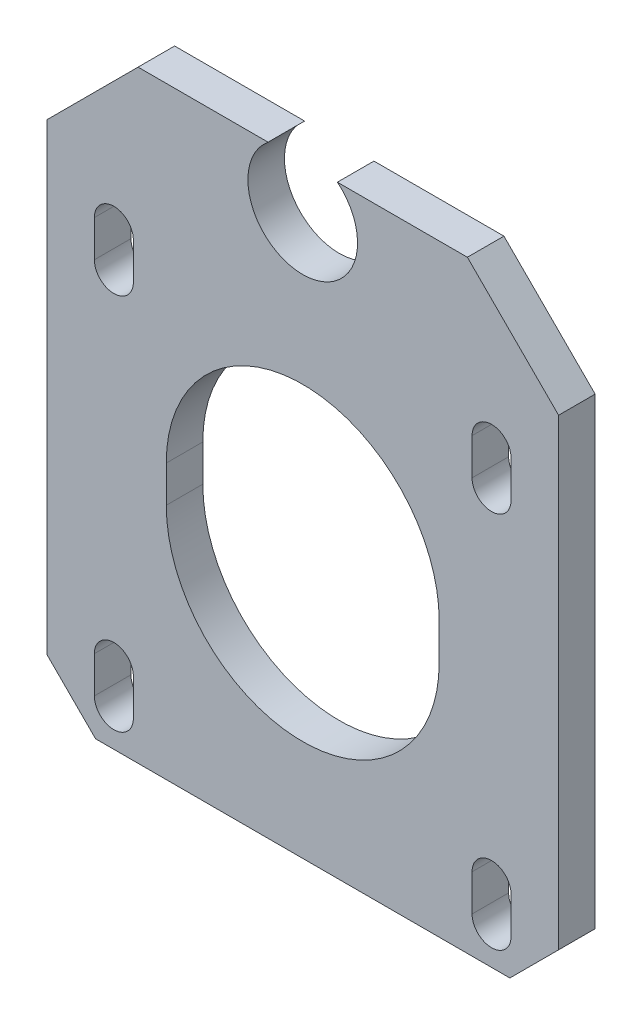
ISO-10303-21;
HEADER;
FILE_DESCRIPTION(('STEP AP214'),'2;1');
FILE_NAME('part.step','',(''),(''),'','','');
FILE_SCHEMA(('AUTOMOTIVE_DESIGN { 1 0 10303 214 1 1 1 1 }'));
ENDSEC;
DATA;
#1=APPLICATION_CONTEXT('core data for automotive mechanical design processes');
#2=APPLICATION_PROTOCOL_DEFINITION('international standard','automotive_design',2000,#1);
#3=PRODUCT_CONTEXT('',#1,'mechanical');
#4=PRODUCT('Part','Part','',(#3));
#5=PRODUCT_RELATED_PRODUCT_CATEGORY('part','',(#4));
#6=PRODUCT_DEFINITION_FORMATION('','',#4);
#7=PRODUCT_DEFINITION_CONTEXT('part definition',#1,'design');
#8=PRODUCT_DEFINITION('design','',#6,#7);
#9=PRODUCT_DEFINITION_SHAPE('','',#8);
#10=(LENGTH_UNIT() NAMED_UNIT(*) SI_UNIT(.MILLI.,.METRE.));
#11=(NAMED_UNIT(*) PLANE_ANGLE_UNIT() SI_UNIT($,.RADIAN.));
#12=(NAMED_UNIT(*) SI_UNIT($,.STERADIAN.) SOLID_ANGLE_UNIT());
#13=UNCERTAINTY_MEASURE_WITH_UNIT(LENGTH_MEASURE(1.E-05),#10,'distance_accuracy_value','');
#14=(GEOMETRIC_REPRESENTATION_CONTEXT(3) GLOBAL_UNCERTAINTY_ASSIGNED_CONTEXT((#13)) GLOBAL_UNIT_ASSIGNED_CONTEXT((#10,
#11,#12)) REPRESENTATION_CONTEXT('',''));
#15=CARTESIAN_POINT('',(0.,0.,0.));
#16=DIRECTION('',(0.,0.,1.));
#17=DIRECTION('',(1.,0.,0.));
#18=AXIS2_PLACEMENT_3D('',#15,#16,#17);
#19=CARTESIAN_POINT('',(0.,25.,3.));
#20=DIRECTION('',(0.,0.,1.));
#21=DIRECTION('',(1.,0.,0.));
#22=AXIS2_PLACEMENT_3D('',#19,#20,#21);
#23=PLANE('',#22);
#24=DIRECTION('',(1.,0.,0.));
#25=VECTOR('',#24,1.);
#26=CARTESIAN_POINT('',(-21.,-21.,3.));
#27=LINE('',#26,#25);
#28=CARTESIAN_POINT('',(-17.,-21.,3.));
#29=VERTEX_POINT('',#28);
#30=CARTESIAN_POINT('',(17.,-21.,3.));
#31=VERTEX_POINT('',#30);
#32=EDGE_CURVE('E485',#29,#31,#27,.T.);
#33=ORIENTED_EDGE('',*,*,#32,.T.);
#34=DIRECTION('',(-0.707106781186549,-0.707106781186546,0.));
#35=VECTOR('',#34,1.);
#36=CARTESIAN_POINT('',(31.5,-6.50000000000007,3.));
#37=LINE('',#36,#35);
#38=CARTESIAN_POINT('',(21.,-17.,3.));
#39=VERTEX_POINT('',#38);
#40=EDGE_CURVE('E45',#31,#39,#37,.F.);
#41=ORIENTED_EDGE('',*,*,#40,.T.);
#42=DIRECTION('',(0.,1.,0.));
#43=VECTOR('',#42,1.);
#44=CARTESIAN_POINT('',(21.,-21.,3.));
#45=LINE('',#44,#43);
#46=CARTESIAN_POINT('',(21.,21.,3.));
#47=VERTEX_POINT('',#46);
#48=EDGE_CURVE('E463',#39,#47,#45,.T.);
#49=ORIENTED_EDGE('',*,*,#48,.T.);
#50=DIRECTION('',(-0.707106781186547,0.707106781186548,0.));
#51=VECTOR('',#50,1.);
#52=CARTESIAN_POINT('',(21.,21.,3.));
#53=LINE('',#52,#51);
#54=CARTESIAN_POINT('',(13.5135929986998,28.4864070013002,3.));
#55=VERTEX_POINT('',#54);
#56=EDGE_CURVE('E466',#47,#55,#53,.T.);
#57=ORIENTED_EDGE('',*,*,#56,.T.);
#58=DIRECTION('',(-1.,0.,0.));
#59=VECTOR('',#58,1.);
#60=CARTESIAN_POINT('',(2.84516541193743,28.4864070013002,3.));
#61=LINE('',#60,#59);
#62=CARTESIAN_POINT('',(2.84516541193743,28.4864070013002,3.));
#63=VERTEX_POINT('',#62);
#64=EDGE_CURVE('E470',#55,#63,#61,.T.);
#65=ORIENTED_EDGE('',*,*,#64,.T.);
#66=CARTESIAN_POINT('',(0.,25.,3.));
#67=DIRECTION('',(0.,0.,-1.));
#68=DIRECTION('',(1.,0.,0.));
#69=AXIS2_PLACEMENT_3D('',#66,#67,#68);
#70=CIRCLE('',#69,4.5);
#71=CARTESIAN_POINT('',(-2.84516541193743,28.4864070013002,3.));
#72=VERTEX_POINT('',#71);
#73=EDGE_CURVE('E473',#63,#72,#70,.T.);
#74=ORIENTED_EDGE('',*,*,#73,.T.);
#75=DIRECTION('',(-1.,0.,0.));
#76=VECTOR('',#75,1.);
#77=CARTESIAN_POINT('',(-2.84516541193743,28.4864070013002,3.));
#78=LINE('',#77,#76);
#79=CARTESIAN_POINT('',(-13.5135929986998,28.4864070013002,3.));
#80=VERTEX_POINT('',#79);
#81=EDGE_CURVE('E476',#72,#80,#78,.T.);
#82=ORIENTED_EDGE('',*,*,#81,.T.);
#83=DIRECTION('',(-0.707106781186547,-0.707106781186548,0.));
#84=VECTOR('',#83,1.);
#85=CARTESIAN_POINT('',(-21.,21.,3.));
#86=LINE('',#85,#84);
#87=CARTESIAN_POINT('',(-21.,21.,3.));
#88=VERTEX_POINT('',#87);
#89=EDGE_CURVE('E479',#80,#88,#86,.T.);
#90=ORIENTED_EDGE('',*,*,#89,.T.);
#91=DIRECTION('',(0.,-1.,0.));
#92=VECTOR('',#91,1.);
#93=CARTESIAN_POINT('',(-21.,-21.,3.));
#94=LINE('',#93,#92);
#95=CARTESIAN_POINT('',(-21.,-17.,3.));
#96=VERTEX_POINT('',#95);
#97=EDGE_CURVE('E482',#88,#96,#94,.T.);
#98=ORIENTED_EDGE('',*,*,#97,.T.);
#99=DIRECTION('',(-0.707106781186546,0.707106781186549,0.));
#100=VECTOR('',#99,1.);
#101=CARTESIAN_POINT('',(-31.5000000000001,-6.49999999999989,3.));
#102=LINE('',#101,#100);
#103=EDGE_CURVE('E549',#96,#29,#102,.F.);
#104=ORIENTED_EDGE('',*,*,#103,.T.);
#105=EDGE_LOOP('',(#33,#41,#49,#57,#65,#74,#82,#90,#98,#104));
#106=FACE_BOUND('',#105,.T.);
#107=DIRECTION('',(0.,-1.,0.));
#108=VECTOR('',#107,1.);
#109=CARTESIAN_POINT('',(-11.2,1.49999999999999,3.));
#110=LINE('',#109,#108);
#111=CARTESIAN_POINT('',(-11.2,1.49999999999999,3.));
#112=VERTEX_POINT('',#111);
#113=CARTESIAN_POINT('',(-11.2,-1.50000000000001,3.));
#114=VERTEX_POINT('',#113);
#115=EDGE_CURVE('E423',#112,#114,#110,.T.);
#116=ORIENTED_EDGE('',*,*,#115,.F.);
#117=CARTESIAN_POINT('',(0.,1.49999999999999,3.));
#118=DIRECTION('',(0.,0.,1.));
#119=DIRECTION('',(1.,0.,0.));
#120=AXIS2_PLACEMENT_3D('',#117,#118,#119);
#121=CIRCLE('',#120,11.2);
#122=CARTESIAN_POINT('',(11.2,1.49999999999998,3.));
#123=VERTEX_POINT('',#122);
#124=EDGE_CURVE('E420',#123,#112,#121,.T.);
#125=ORIENTED_EDGE('',*,*,#124,.F.);
#126=DIRECTION('',(0.,1.,0.));
#127=VECTOR('',#126,1.);
#128=CARTESIAN_POINT('',(11.2,1.49999999999998,3.));
#129=LINE('',#128,#127);
#130=CARTESIAN_POINT('',(11.2,-1.50000000000001,3.));
#131=VERTEX_POINT('',#130);
#132=EDGE_CURVE('E431',#131,#123,#129,.T.);
#133=ORIENTED_EDGE('',*,*,#132,.F.);
#134=CARTESIAN_POINT('',(0.,-1.50000000000001,3.));
#135=DIRECTION('',(0.,0.,1.));
#136=DIRECTION('',(1.,0.,0.));
#137=AXIS2_PLACEMENT_3D('',#134,#135,#136);
#138=CIRCLE('',#137,11.2);
#139=EDGE_CURVE('E427',#114,#131,#138,.T.);
#140=ORIENTED_EDGE('',*,*,#139,.F.);
#141=EDGE_LOOP('',(#116,#125,#133,#140));
#142=FACE_BOUND('',#141,.T.);
#143=DIRECTION('',(0.,-1.,0.));
#144=VECTOR('',#143,1.);
#145=CARTESIAN_POINT('',(13.9,-15.,3.));
#146=LINE('',#145,#144);
#147=CARTESIAN_POINT('',(13.9,-15.,3.));
#148=VERTEX_POINT('',#147);
#149=CARTESIAN_POINT('',(13.9,-18.,3.));
#150=VERTEX_POINT('',#149);
#151=EDGE_CURVE('E381',#148,#150,#146,.T.);
#152=ORIENTED_EDGE('',*,*,#151,.F.);
#153=CARTESIAN_POINT('',(15.5,-15.,3.));
#154=DIRECTION('',(0.,0.,1.));
#155=DIRECTION('',(-1.,0.,0.));
#156=AXIS2_PLACEMENT_3D('',#153,#154,#155);
#157=CIRCLE('',#156,1.59999999999999);
#158=CARTESIAN_POINT('',(17.1,-15.,3.));
#159=VERTEX_POINT('',#158);
#160=EDGE_CURVE('E378',#159,#148,#157,.T.);
#161=ORIENTED_EDGE('',*,*,#160,.F.);
#162=DIRECTION('',(0.,1.,0.));
#163=VECTOR('',#162,1.);
#164=CARTESIAN_POINT('',(17.1,-15.,3.));
#165=LINE('',#164,#163);
#166=CARTESIAN_POINT('',(17.1,-18.,3.));
#167=VERTEX_POINT('',#166);
#168=EDGE_CURVE('E388',#167,#159,#165,.T.);
#169=ORIENTED_EDGE('',*,*,#168,.F.);
#170=CARTESIAN_POINT('',(15.5,-18.,3.));
#171=DIRECTION('',(0.,0.,1.));
#172=DIRECTION('',(-1.,0.,0.));
#173=AXIS2_PLACEMENT_3D('',#170,#171,#172);
#174=CIRCLE('',#173,1.59999999999999);
#175=EDGE_CURVE('E384',#150,#167,#174,.T.);
#176=ORIENTED_EDGE('',*,*,#175,.F.);
#177=EDGE_LOOP('',(#152,#161,#169,#176));
#178=FACE_BOUND('',#177,.T.);
#179=DIRECTION('',(0.,-1.,0.));
#180=VECTOR('',#179,1.);
#181=CARTESIAN_POINT('',(-17.1,-15.,3.));
#182=LINE('',#181,#180);
#183=CARTESIAN_POINT('',(-17.1,-15.,3.));
#184=VERTEX_POINT('',#183);
#185=CARTESIAN_POINT('',(-17.1,-18.,3.));
#186=VERTEX_POINT('',#185);
#187=EDGE_CURVE('E338',#184,#186,#182,.T.);
#188=ORIENTED_EDGE('',*,*,#187,.F.);
#189=CARTESIAN_POINT('',(-15.5,-15.,3.));
#190=DIRECTION('',(0.,0.,1.));
#191=DIRECTION('',(1.,0.,0.));
#192=AXIS2_PLACEMENT_3D('',#189,#190,#191);
#193=CIRCLE('',#192,1.59999999999999);
#194=CARTESIAN_POINT('',(-13.9,-15.,3.));
#195=VERTEX_POINT('',#194);
#196=EDGE_CURVE('E335',#195,#184,#193,.T.);
#197=ORIENTED_EDGE('',*,*,#196,.F.);
#198=DIRECTION('',(0.,1.,0.));
#199=VECTOR('',#198,1.);
#200=CARTESIAN_POINT('',(-13.9,-15.,3.));
#201=LINE('',#200,#199);
#202=CARTESIAN_POINT('',(-13.9,-18.,3.));
#203=VERTEX_POINT('',#202);
#204=EDGE_CURVE('E346',#203,#195,#201,.T.);
#205=ORIENTED_EDGE('',*,*,#204,.F.);
#206=CARTESIAN_POINT('',(-15.5,-18.,3.));
#207=DIRECTION('',(0.,0.,1.));
#208=DIRECTION('',(1.,0.,0.));
#209=AXIS2_PLACEMENT_3D('',#206,#207,#208);
#210=CIRCLE('',#209,1.59999999999999);
#211=EDGE_CURVE('E342',#186,#203,#210,.T.);
#212=ORIENTED_EDGE('',*,*,#211,.F.);
#213=EDGE_LOOP('',(#188,#197,#205,#212));
#214=FACE_BOUND('',#213,.T.);
#215=DIRECTION('',(0.,-1.,0.));
#216=VECTOR('',#215,1.);
#217=CARTESIAN_POINT('',(-17.1,16.,3.));
#218=LINE('',#217,#216);
#219=CARTESIAN_POINT('',(-17.1,16.,3.));
#220=VERTEX_POINT('',#219);
#221=CARTESIAN_POINT('',(-17.1,13.,3.));
#222=VERTEX_POINT('',#221);
#223=EDGE_CURVE('E295',#220,#222,#218,.T.);
#224=ORIENTED_EDGE('',*,*,#223,.F.);
#225=CARTESIAN_POINT('',(-15.5,16.,3.));
#226=DIRECTION('',(0.,0.,1.));
#227=DIRECTION('',(1.,0.,0.));
#228=AXIS2_PLACEMENT_3D('',#225,#226,#227);
#229=CIRCLE('',#228,1.6);
#230=CARTESIAN_POINT('',(-13.9,16.,3.));
#231=VERTEX_POINT('',#230);
#232=EDGE_CURVE('E292',#231,#220,#229,.T.);
#233=ORIENTED_EDGE('',*,*,#232,.F.);
#234=DIRECTION('',(0.,1.,0.));
#235=VECTOR('',#234,1.);
#236=CARTESIAN_POINT('',(-13.9,16.,3.));
#237=LINE('',#236,#235);
#238=CARTESIAN_POINT('',(-13.9,13.,3.));
#239=VERTEX_POINT('',#238);
#240=EDGE_CURVE('E303',#239,#231,#237,.T.);
#241=ORIENTED_EDGE('',*,*,#240,.F.);
#242=CARTESIAN_POINT('',(-15.5,13.,3.));
#243=DIRECTION('',(0.,0.,1.));
#244=DIRECTION('',(1.,0.,0.));
#245=AXIS2_PLACEMENT_3D('',#242,#243,#244);
#246=CIRCLE('',#245,1.6);
#247=EDGE_CURVE('E299',#222,#239,#246,.T.);
#248=ORIENTED_EDGE('',*,*,#247,.F.);
#249=EDGE_LOOP('',(#224,#233,#241,#248));
#250=FACE_BOUND('',#249,.T.);
#251=DIRECTION('',(0.,-1.,0.));
#252=VECTOR('',#251,1.);
#253=CARTESIAN_POINT('',(13.9,16.,3.));
#254=LINE('',#253,#252);
#255=CARTESIAN_POINT('',(13.9,16.,3.));
#256=VERTEX_POINT('',#255);
#257=CARTESIAN_POINT('',(13.9,13.,3.));
#258=VERTEX_POINT('',#257);
#259=EDGE_CURVE('E248',#256,#258,#254,.T.);
#260=ORIENTED_EDGE('',*,*,#259,.F.);
#261=CARTESIAN_POINT('',(15.5,16.,3.));
#262=DIRECTION('',(0.,0.,1.));
#263=DIRECTION('',(-1.,0.,0.));
#264=AXIS2_PLACEMENT_3D('',#261,#262,#263);
#265=CIRCLE('',#264,1.6);
#266=CARTESIAN_POINT('',(17.1,16.,3.));
#267=VERTEX_POINT('',#266);
#268=EDGE_CURVE('E237',#267,#256,#265,.T.);
#269=ORIENTED_EDGE('',*,*,#268,.F.);
#270=DIRECTION('',(0.,1.,0.));
#271=VECTOR('',#270,1.);
#272=CARTESIAN_POINT('',(17.1,16.,3.));
#273=LINE('',#272,#271);
#274=CARTESIAN_POINT('',(17.1,13.,3.));
#275=VERTEX_POINT('',#274);
#276=EDGE_CURVE('E268',#275,#267,#273,.T.);
#277=ORIENTED_EDGE('',*,*,#276,.F.);
#278=CARTESIAN_POINT('',(15.5,13.,3.));
#279=DIRECTION('',(0.,0.,1.));
#280=DIRECTION('',(-1.,0.,0.));
#281=AXIS2_PLACEMENT_3D('',#278,#279,#280);
#282=CIRCLE('',#281,1.6);
#283=EDGE_CURVE('E262',#258,#275,#282,.T.);
#284=ORIENTED_EDGE('',*,*,#283,.F.);
#285=EDGE_LOOP('',(#260,#269,#277,#284));
#286=FACE_BOUND('',#285,.T.);
#287=ADVANCED_FACE('F36',(#106,#142,#178,#214,#250,#286),#23,.T.);
#288=CARTESIAN_POINT('',(0.,25.,0.));
#289=DIRECTION('',(0.,0.,1.));
#290=DIRECTION('',(1.,0.,0.));
#291=AXIS2_PLACEMENT_3D('',#288,#289,#290);
#292=PLANE('',#291);
#293=CARTESIAN_POINT('',(-15.5,16.,0.));
#294=DIRECTION('',(0.,0.,1.));
#295=DIRECTION('',(1.,0.,0.));
#296=AXIS2_PLACEMENT_3D('',#293,#294,#295);
#297=CIRCLE('',#296,1.6);
#298=CARTESIAN_POINT('',(-13.9,16.,0.));
#299=VERTEX_POINT('',#298);
#300=CARTESIAN_POINT('',(-17.1,16.,0.));
#301=VERTEX_POINT('',#300);
#302=EDGE_CURVE('E257',#299,#301,#297,.T.);
#303=ORIENTED_EDGE('',*,*,#302,.T.);
#304=DIRECTION('',(0.,-1.,0.));
#305=VECTOR('',#304,1.);
#306=CARTESIAN_POINT('',(-17.1,16.,0.));
#307=LINE('',#306,#305);
#308=CARTESIAN_POINT('',(-17.1,13.,0.));
#309=VERTEX_POINT('',#308);
#310=EDGE_CURVE('E310',#301,#309,#307,.T.);
#311=ORIENTED_EDGE('',*,*,#310,.T.);
#312=CARTESIAN_POINT('',(-15.5,13.,0.));
#313=DIRECTION('',(0.,0.,1.));
#314=DIRECTION('',(1.,0.,0.));
#315=AXIS2_PLACEMENT_3D('',#312,#313,#314);
#316=CIRCLE('',#315,1.6);
#317=CARTESIAN_POINT('',(-13.9,13.,0.));
#318=VERTEX_POINT('',#317);
#319=EDGE_CURVE('E314',#309,#318,#316,.T.);
#320=ORIENTED_EDGE('',*,*,#319,.T.);
#321=DIRECTION('',(0.,1.,0.));
#322=VECTOR('',#321,1.);
#323=CARTESIAN_POINT('',(-13.9,16.,0.));
#324=LINE('',#323,#322);
#325=EDGE_CURVE('E296',#318,#299,#324,.T.);
#326=ORIENTED_EDGE('',*,*,#325,.T.);
#327=EDGE_LOOP('',(#303,#311,#320,#326));
#328=FACE_BOUND('',#327,.T.);
#329=CARTESIAN_POINT('',(15.5,-15.,0.));
#330=DIRECTION('',(0.,0.,1.));
#331=DIRECTION('',(-1.,0.,0.));
#332=AXIS2_PLACEMENT_3D('',#329,#330,#331);
#333=CIRCLE('',#332,1.59999999999999);
#334=CARTESIAN_POINT('',(17.1,-15.,0.));
#335=VERTEX_POINT('',#334);
#336=CARTESIAN_POINT('',(13.9,-15.,0.));
#337=VERTEX_POINT('',#336);
#338=EDGE_CURVE('E377',#335,#337,#333,.T.);
#339=ORIENTED_EDGE('',*,*,#338,.T.);
#340=DIRECTION('',(0.,-1.,0.));
#341=VECTOR('',#340,1.);
#342=CARTESIAN_POINT('',(13.9,-15.,0.));
#343=LINE('',#342,#341);
#344=CARTESIAN_POINT('',(13.9,-18.,0.));
#345=VERTEX_POINT('',#344);
#346=EDGE_CURVE('E395',#337,#345,#343,.T.);
#347=ORIENTED_EDGE('',*,*,#346,.T.);
#348=CARTESIAN_POINT('',(15.5,-18.,0.));
#349=DIRECTION('',(0.,0.,1.));
#350=DIRECTION('',(-1.,0.,0.));
#351=AXIS2_PLACEMENT_3D('',#348,#349,#350);
#352=CIRCLE('',#351,1.59999999999999);
#353=CARTESIAN_POINT('',(17.1,-18.,0.));
#354=VERTEX_POINT('',#353);
#355=EDGE_CURVE('E399',#345,#354,#352,.T.);
#356=ORIENTED_EDGE('',*,*,#355,.T.);
#357=DIRECTION('',(0.,1.,0.));
#358=VECTOR('',#357,1.);
#359=CARTESIAN_POINT('',(17.1,-15.,0.));
#360=LINE('',#359,#358);
#361=EDGE_CURVE('E382',#354,#335,#360,.T.);
#362=ORIENTED_EDGE('',*,*,#361,.T.);
#363=EDGE_LOOP('',(#339,#347,#356,#362));
#364=FACE_BOUND('',#363,.T.);
#365=DIRECTION('',(0.,1.,0.));
#366=VECTOR('',#365,1.);
#367=CARTESIAN_POINT('',(21.,-21.,0.));
#368=LINE('',#367,#366);
#369=CARTESIAN_POINT('',(21.,-17.,0.));
#370=VERTEX_POINT('',#369);
#371=CARTESIAN_POINT('',(21.,21.,0.));
#372=VERTEX_POINT('',#371);
#373=EDGE_CURVE('E462',#370,#372,#368,.T.);
#374=ORIENTED_EDGE('',*,*,#373,.F.);
#375=DIRECTION('',(0.707106781186549,0.707106781186546,0.));
#376=VECTOR('',#375,1.);
#377=CARTESIAN_POINT('',(21.,-17.,0.));
#378=LINE('',#377,#376);
#379=CARTESIAN_POINT('',(17.,-21.,0.));
#380=VERTEX_POINT('',#379);
#381=EDGE_CURVE('E540',#370,#380,#378,.F.);
#382=ORIENTED_EDGE('',*,*,#381,.T.);
#383=DIRECTION('',(1.,0.,0.));
#384=VECTOR('',#383,1.);
#385=CARTESIAN_POINT('',(-21.,-21.,0.));
#386=LINE('',#385,#384);
#387=CARTESIAN_POINT('',(-17.,-21.,0.));
#388=VERTEX_POINT('',#387);
#389=EDGE_CURVE('E467',#388,#380,#386,.T.);
#390=ORIENTED_EDGE('',*,*,#389,.F.);
#391=DIRECTION('',(0.707106781186546,-0.707106781186549,0.));
#392=VECTOR('',#391,1.);
#393=CARTESIAN_POINT('',(-17.,-21.,0.));
#394=LINE('',#393,#392);
#395=CARTESIAN_POINT('',(-21.,-17.,0.));
#396=VERTEX_POINT('',#395);
#397=EDGE_CURVE('E537',#388,#396,#394,.F.);
#398=ORIENTED_EDGE('',*,*,#397,.T.);
#399=DIRECTION('',(0.,-1.,0.));
#400=VECTOR('',#399,1.);
#401=CARTESIAN_POINT('',(-21.,-21.,0.));
#402=LINE('',#401,#400);
#403=CARTESIAN_POINT('',(-21.,21.,0.));
#404=VERTEX_POINT('',#403);
#405=EDGE_CURVE('E506',#404,#396,#402,.T.);
#406=ORIENTED_EDGE('',*,*,#405,.F.);
#407=DIRECTION('',(-0.707106781186547,-0.707106781186548,0.));
#408=VECTOR('',#407,1.);
#409=CARTESIAN_POINT('',(-21.,21.,0.));
#410=LINE('',#409,#408);
#411=CARTESIAN_POINT('',(-13.5135929986998,28.4864070013002,0.));
#412=VERTEX_POINT('',#411);
#413=EDGE_CURVE('E503',#412,#404,#410,.T.);
#414=ORIENTED_EDGE('',*,*,#413,.F.);
#415=DIRECTION('',(-1.,0.,0.));
#416=VECTOR('',#415,1.);
#417=CARTESIAN_POINT('',(-2.84516541193743,28.4864070013002,0.));
#418=LINE('',#417,#416);
#419=CARTESIAN_POINT('',(-2.84516541193743,28.4864070013002,0.));
#420=VERTEX_POINT('',#419);
#421=EDGE_CURVE('E500',#420,#412,#418,.T.);
#422=ORIENTED_EDGE('',*,*,#421,.F.);
#423=CARTESIAN_POINT('',(0.,25.,0.));
#424=DIRECTION('',(0.,0.,-1.));
#425=DIRECTION('',(1.,0.,0.));
#426=AXIS2_PLACEMENT_3D('',#423,#424,#425);
#427=CIRCLE('',#426,4.5);
#428=CARTESIAN_POINT('',(2.84516541193743,28.4864070013002,0.));
#429=VERTEX_POINT('',#428);
#430=EDGE_CURVE('E497',#429,#420,#427,.T.);
#431=ORIENTED_EDGE('',*,*,#430,.F.);
#432=DIRECTION('',(-1.,0.,0.));
#433=VECTOR('',#432,1.);
#434=CARTESIAN_POINT('',(2.84516541193743,28.4864070013002,0.));
#435=LINE('',#434,#433);
#436=CARTESIAN_POINT('',(13.5135929986998,28.4864070013002,0.));
#437=VERTEX_POINT('',#436);
#438=EDGE_CURVE('E494',#437,#429,#435,.T.);
#439=ORIENTED_EDGE('',*,*,#438,.F.);
#440=DIRECTION('',(-0.707106781186547,0.707106781186548,0.));
#441=VECTOR('',#440,1.);
#442=CARTESIAN_POINT('',(21.,21.,0.));
#443=LINE('',#442,#441);
#444=EDGE_CURVE('E491',#372,#437,#443,.T.);
#445=ORIENTED_EDGE('',*,*,#444,.F.);
#446=EDGE_LOOP('',(#374,#382,#390,#398,#406,#414,#422,#431,#439,#445));
#447=FACE_BOUND('',#446,.T.);
#448=CARTESIAN_POINT('',(0.,1.49999999999999,0.));
#449=DIRECTION('',(0.,0.,1.));
#450=DIRECTION('',(1.,0.,0.));
#451=AXIS2_PLACEMENT_3D('',#448,#449,#450);
#452=CIRCLE('',#451,11.2);
#453=CARTESIAN_POINT('',(11.2,1.49999999999998,0.));
#454=VERTEX_POINT('',#453);
#455=CARTESIAN_POINT('',(-11.2,1.49999999999999,0.));
#456=VERTEX_POINT('',#455);
#457=EDGE_CURVE('E419',#454,#456,#452,.T.);
#458=ORIENTED_EDGE('',*,*,#457,.T.);
#459=DIRECTION('',(0.,-1.,0.));
#460=VECTOR('',#459,1.);
#461=CARTESIAN_POINT('',(-11.2,1.49999999999999,0.));
#462=LINE('',#461,#460);
#463=CARTESIAN_POINT('',(-11.2,-1.50000000000001,0.));
#464=VERTEX_POINT('',#463);
#465=EDGE_CURVE('E438',#456,#464,#462,.T.);
#466=ORIENTED_EDGE('',*,*,#465,.T.);
#467=CARTESIAN_POINT('',(0.,-1.50000000000001,0.));
#468=DIRECTION('',(0.,0.,1.));
#469=DIRECTION('',(1.,0.,0.));
#470=AXIS2_PLACEMENT_3D('',#467,#468,#469);
#471=CIRCLE('',#470,11.2);
#472=CARTESIAN_POINT('',(11.2,-1.50000000000001,0.));
#473=VERTEX_POINT('',#472);
#474=EDGE_CURVE('E442',#464,#473,#471,.T.);
#475=ORIENTED_EDGE('',*,*,#474,.T.);
#476=DIRECTION('',(0.,1.,0.));
#477=VECTOR('',#476,1.);
#478=CARTESIAN_POINT('',(11.2,1.49999999999998,0.));
#479=LINE('',#478,#477);
#480=EDGE_CURVE('E424',#473,#454,#479,.T.);
#481=ORIENTED_EDGE('',*,*,#480,.T.);
#482=EDGE_LOOP('',(#458,#466,#475,#481));
#483=FACE_BOUND('',#482,.T.);
#484=CARTESIAN_POINT('',(-15.5,-15.,0.));
#485=DIRECTION('',(0.,0.,1.));
#486=DIRECTION('',(1.,0.,0.));
#487=AXIS2_PLACEMENT_3D('',#484,#485,#486);
#488=CIRCLE('',#487,1.59999999999999);
#489=CARTESIAN_POINT('',(-13.9,-15.,0.));
#490=VERTEX_POINT('',#489);
#491=CARTESIAN_POINT('',(-17.1,-15.,0.));
#492=VERTEX_POINT('',#491);
#493=EDGE_CURVE('E334',#490,#492,#488,.T.);
#494=ORIENTED_EDGE('',*,*,#493,.T.);
#495=DIRECTION('',(0.,-1.,0.));
#496=VECTOR('',#495,1.);
#497=CARTESIAN_POINT('',(-17.1,-15.,0.));
#498=LINE('',#497,#496);
#499=CARTESIAN_POINT('',(-17.1,-18.,0.));
#500=VERTEX_POINT('',#499);
#501=EDGE_CURVE('E353',#492,#500,#498,.T.);
#502=ORIENTED_EDGE('',*,*,#501,.T.);
#503=CARTESIAN_POINT('',(-15.5,-18.,0.));
#504=DIRECTION('',(0.,0.,1.));
#505=DIRECTION('',(1.,0.,0.));
#506=AXIS2_PLACEMENT_3D('',#503,#504,#505);
#507=CIRCLE('',#506,1.59999999999999);
#508=CARTESIAN_POINT('',(-13.9,-18.,0.));
#509=VERTEX_POINT('',#508);
#510=EDGE_CURVE('E357',#500,#509,#507,.T.);
#511=ORIENTED_EDGE('',*,*,#510,.T.);
#512=DIRECTION('',(0.,1.,0.));
#513=VECTOR('',#512,1.);
#514=CARTESIAN_POINT('',(-13.9,-15.,0.));
#515=LINE('',#514,#513);
#516=EDGE_CURVE('E339',#509,#490,#515,.T.);
#517=ORIENTED_EDGE('',*,*,#516,.T.);
#518=EDGE_LOOP('',(#494,#502,#511,#517));
#519=FACE_BOUND('',#518,.T.);
#520=CARTESIAN_POINT('',(15.5,16.,0.));
#521=DIRECTION('',(0.,0.,1.));
#522=DIRECTION('',(-1.,0.,0.));
#523=AXIS2_PLACEMENT_3D('',#520,#521,#522);
#524=CIRCLE('',#523,1.6);
#525=CARTESIAN_POINT('',(17.1,16.,0.));
#526=VERTEX_POINT('',#525);
#527=CARTESIAN_POINT('',(13.9,16.,0.));
#528=VERTEX_POINT('',#527);
#529=EDGE_CURVE('E273',#526,#528,#524,.T.);
#530=ORIENTED_EDGE('',*,*,#529,.T.);
#531=DIRECTION('',(0.,-1.,0.));
#532=VECTOR('',#531,1.);
#533=CARTESIAN_POINT('',(13.9,16.,0.));
#534=LINE('',#533,#532);
#535=CARTESIAN_POINT('',(13.9,13.,0.));
#536=VERTEX_POINT('',#535);
#537=EDGE_CURVE('E255',#528,#536,#534,.T.);
#538=ORIENTED_EDGE('',*,*,#537,.T.);
#539=CARTESIAN_POINT('',(15.5,13.,0.));
#540=DIRECTION('',(0.,0.,1.));
#541=DIRECTION('',(-1.,0.,0.));
#542=AXIS2_PLACEMENT_3D('',#539,#540,#541);
#543=CIRCLE('',#542,1.6);
#544=CARTESIAN_POINT('',(17.1,13.,0.));
#545=VERTEX_POINT('',#544);
#546=EDGE_CURVE('E278',#536,#545,#543,.T.);
#547=ORIENTED_EDGE('',*,*,#546,.T.);
#548=DIRECTION('',(0.,1.,0.));
#549=VECTOR('',#548,1.);
#550=CARTESIAN_POINT('',(17.1,16.,0.));
#551=LINE('',#550,#549);
#552=EDGE_CURVE('E249',#545,#526,#551,.T.);
#553=ORIENTED_EDGE('',*,*,#552,.T.);
#554=EDGE_LOOP('',(#530,#538,#547,#553));
#555=FACE_BOUND('',#554,.T.);
#556=ADVANCED_FACE('F566',(#328,#364,#447,#483,#519,#555),#292,.F.);
#557=CARTESIAN_POINT('',(21.,-21.,3.));
#558=DIRECTION('',(-1.,0.,0.));
#559=DIRECTION('',(0.,0.,1.));
#560=AXIS2_PLACEMENT_3D('',#557,#558,#559);
#561=PLANE('',#560);
#562=ORIENTED_EDGE('',*,*,#48,.F.);
#563=DIRECTION('',(0.,0.,-1.));
#564=VECTOR('',#563,1.);
#565=CARTESIAN_POINT('',(21.,-17.,3.));
#566=LINE('',#565,#564);
#567=EDGE_CURVE('E533',#39,#370,#566,.T.);
#568=ORIENTED_EDGE('',*,*,#567,.T.);
#569=ORIENTED_EDGE('',*,*,#373,.T.);
#570=DIRECTION('',(0.,0.,-1.));
#571=VECTOR('',#570,1.);
#572=CARTESIAN_POINT('',(21.,21.,3.));
#573=LINE('',#572,#571);
#574=EDGE_CURVE('E529',#47,#372,#573,.T.);
#575=ORIENTED_EDGE('',*,*,#574,.F.);
#576=EDGE_LOOP('',(#562,#568,#569,#575));
#577=FACE_BOUND('',#576,.T.);
#578=ADVANCED_FACE('F561',(#577),#561,.F.);
#579=CARTESIAN_POINT('',(21.,21.,3.));
#580=DIRECTION('',(-0.707106781186548,-0.707106781186547,0.));
#581=DIRECTION('',(0.707106781186547,-0.707106781186548,0.));
#582=AXIS2_PLACEMENT_3D('',#579,#580,#581);
#583=PLANE('',#582);
#584=ORIENTED_EDGE('',*,*,#444,.T.);
#585=DIRECTION('',(0.,0.,-1.));
#586=VECTOR('',#585,1.);
#587=CARTESIAN_POINT('',(13.5135929986998,28.4864070013002,3.));
#588=LINE('',#587,#586);
#589=EDGE_CURVE('E525',#55,#437,#588,.T.);
#590=ORIENTED_EDGE('',*,*,#589,.F.);
#591=ORIENTED_EDGE('',*,*,#56,.F.);
#592=ORIENTED_EDGE('',*,*,#574,.T.);
#593=EDGE_LOOP('',(#584,#590,#591,#592));
#594=FACE_BOUND('',#593,.T.);
#595=ADVANCED_FACE('F597',(#594),#583,.F.);
#596=CARTESIAN_POINT('',(2.84516541193743,28.4864070013002,3.));
#597=DIRECTION('',(0.,-1.,0.));
#598=DIRECTION('',(1.,0.,0.));
#599=AXIS2_PLACEMENT_3D('',#596,#597,#598);
#600=PLANE('',#599);
#601=ORIENTED_EDGE('',*,*,#438,.T.);
#602=DIRECTION('',(0.,0.,-1.));
#603=VECTOR('',#602,1.);
#604=CARTESIAN_POINT('',(2.84516541193743,28.4864070013002,3.));
#605=LINE('',#604,#603);
#606=EDGE_CURVE('E522',#63,#429,#605,.T.);
#607=ORIENTED_EDGE('',*,*,#606,.F.);
#608=ORIENTED_EDGE('',*,*,#64,.F.);
#609=ORIENTED_EDGE('',*,*,#589,.T.);
#610=EDGE_LOOP('',(#601,#607,#608,#609));
#611=FACE_BOUND('',#610,.T.);
#612=ADVANCED_FACE('F594',(#611),#600,.F.);
#613=CARTESIAN_POINT('',(0.,25.,3.));
#614=DIRECTION('',(0.,0.,-1.));
#615=DIRECTION('',(-1.,0.,0.));
#616=AXIS2_PLACEMENT_3D('',#613,#614,#615);
#617=CYLINDRICAL_SURFACE('',#616,4.5);
#618=ORIENTED_EDGE('',*,*,#430,.T.);
#619=DIRECTION('',(0.,0.,-1.));
#620=VECTOR('',#619,1.);
#621=CARTESIAN_POINT('',(-2.84516541193743,28.4864070013002,3.));
#622=LINE('',#621,#620);
#623=EDGE_CURVE('E518',#72,#420,#622,.T.);
#624=ORIENTED_EDGE('',*,*,#623,.F.);
#625=ORIENTED_EDGE('',*,*,#73,.F.);
#626=ORIENTED_EDGE('',*,*,#606,.T.);
#627=EDGE_LOOP('',(#618,#624,#625,#626));
#628=FACE_BOUND('',#627,.T.);
#629=ADVANCED_FACE('F590',(#628),#617,.F.);
#630=CARTESIAN_POINT('',(-2.84516541193743,28.4864070013002,3.));
#631=DIRECTION('',(0.,-1.,0.));
#632=DIRECTION('',(1.,0.,0.));
#633=AXIS2_PLACEMENT_3D('',#630,#631,#632);
#634=PLANE('',#633);
#635=ORIENTED_EDGE('',*,*,#421,.T.);
#636=DIRECTION('',(0.,0.,-1.));
#637=VECTOR('',#636,1.);
#638=CARTESIAN_POINT('',(-13.5135929986998,28.4864070013002,3.));
#639=LINE('',#638,#637);
#640=EDGE_CURVE('E514',#80,#412,#639,.T.);
#641=ORIENTED_EDGE('',*,*,#640,.F.);
#642=ORIENTED_EDGE('',*,*,#81,.F.);
#643=ORIENTED_EDGE('',*,*,#623,.T.);
#644=EDGE_LOOP('',(#635,#641,#642,#643));
#645=FACE_BOUND('',#644,.T.);
#646=ADVANCED_FACE('F585',(#645),#634,.F.);
#647=CARTESIAN_POINT('',(-21.,21.,3.));
#648=DIRECTION('',(0.707106781186548,-0.707106781186547,0.));
#649=DIRECTION('',(0.707106781186547,0.707106781186548,0.));
#650=AXIS2_PLACEMENT_3D('',#647,#648,#649);
#651=PLANE('',#650);
#652=ORIENTED_EDGE('',*,*,#413,.T.);
#653=DIRECTION('',(0.,0.,-1.));
#654=VECTOR('',#653,1.);
#655=CARTESIAN_POINT('',(-21.,21.,3.));
#656=LINE('',#655,#654);
#657=EDGE_CURVE('E488',#88,#404,#656,.T.);
#658=ORIENTED_EDGE('',*,*,#657,.F.);
#659=ORIENTED_EDGE('',*,*,#89,.F.);
#660=ORIENTED_EDGE('',*,*,#640,.T.);
#661=EDGE_LOOP('',(#652,#658,#659,#660));
#662=FACE_BOUND('',#661,.T.);
#663=ADVANCED_FACE('F579',(#662),#651,.F.);
#664=CARTESIAN_POINT('',(-21.,-21.,3.));
#665=DIRECTION('',(1.,0.,0.));
#666=DIRECTION('',(0.,0.,-1.));
#667=AXIS2_PLACEMENT_3D('',#664,#665,#666);
#668=PLANE('',#667);
#669=ORIENTED_EDGE('',*,*,#405,.T.);
#670=DIRECTION('',(0.,0.,1.));
#671=VECTOR('',#670,1.);
#672=CARTESIAN_POINT('',(-21.,-17.,3.));
#673=LINE('',#672,#671);
#674=EDGE_CURVE('E11',#396,#96,#673,.T.);
#675=ORIENTED_EDGE('',*,*,#674,.T.);
#676=ORIENTED_EDGE('',*,*,#97,.F.);
#677=ORIENTED_EDGE('',*,*,#657,.T.);
#678=EDGE_LOOP('',(#669,#675,#676,#677));
#679=FACE_BOUND('',#678,.T.);
#680=ADVANCED_FACE('F575',(#679),#668,.F.);
#681=CARTESIAN_POINT('',(-21.,-21.,3.));
#682=DIRECTION('',(0.,1.,0.));
#683=DIRECTION('',(0.,0.,1.));
#684=AXIS2_PLACEMENT_3D('',#681,#682,#683);
#685=PLANE('',#684);
#686=ORIENTED_EDGE('',*,*,#389,.T.);
#687=DIRECTION('',(0.,0.,1.));
#688=VECTOR('',#687,1.);
#689=CARTESIAN_POINT('',(17.,-21.,3.));
#690=LINE('',#689,#688);
#691=EDGE_CURVE('E58',#380,#31,#690,.T.);
#692=ORIENTED_EDGE('',*,*,#691,.T.);
#693=ORIENTED_EDGE('',*,*,#32,.F.);
#694=DIRECTION('',(0.,0.,-1.));
#695=VECTOR('',#694,1.);
#696=CARTESIAN_POINT('',(-17.,-21.,3.));
#697=LINE('',#696,#695);
#698=EDGE_CURVE('E543',#29,#388,#697,.T.);
#699=ORIENTED_EDGE('',*,*,#698,.T.);
#700=EDGE_LOOP('',(#686,#692,#693,#699));
#701=FACE_BOUND('',#700,.T.);
#702=ADVANCED_FACE('F569',(#701),#685,.F.);
#703=CARTESIAN_POINT('',(0.,1.49999999999999,3.));
#704=DIRECTION('',(0.,0.,-1.));
#705=DIRECTION('',(-1.,0.,0.));
#706=AXIS2_PLACEMENT_3D('',#703,#704,#705);
#707=CYLINDRICAL_SURFACE('',#706,11.2);
#708=ORIENTED_EDGE('',*,*,#457,.F.);
#709=DIRECTION('',(0.,0.,-1.));
#710=VECTOR('',#709,1.);
#711=CARTESIAN_POINT('',(11.2,1.49999999999998,3.));
#712=LINE('',#711,#710);
#713=EDGE_CURVE('E434',#123,#454,#712,.T.);
#714=ORIENTED_EDGE('',*,*,#713,.F.);
#715=ORIENTED_EDGE('',*,*,#124,.T.);
#716=DIRECTION('',(0.,0.,-1.));
#717=VECTOR('',#716,1.);
#718=CARTESIAN_POINT('',(-11.2,1.49999999999999,3.));
#719=LINE('',#718,#717);
#720=EDGE_CURVE('E458',#112,#456,#719,.T.);
#721=ORIENTED_EDGE('',*,*,#720,.T.);
#722=EDGE_LOOP('',(#708,#714,#715,#721));
#723=FACE_BOUND('',#722,.T.);
#724=ADVANCED_FACE('F614',(#723),#707,.F.);
#725=CARTESIAN_POINT('',(-11.2,1.49999999999999,3.));
#726=DIRECTION('',(1.,0.,0.));
#727=DIRECTION('',(0.,1.,0.));
#728=AXIS2_PLACEMENT_3D('',#725,#726,#727);
#729=PLANE('',#728);
#730=ORIENTED_EDGE('',*,*,#465,.F.);
#731=ORIENTED_EDGE('',*,*,#720,.F.);
#732=ORIENTED_EDGE('',*,*,#115,.T.);
#733=DIRECTION('',(0.,0.,-1.));
#734=VECTOR('',#733,1.);
#735=CARTESIAN_POINT('',(-11.2,-1.50000000000001,3.));
#736=LINE('',#735,#734);
#737=EDGE_CURVE('E455',#114,#464,#736,.T.);
#738=ORIENTED_EDGE('',*,*,#737,.T.);
#739=EDGE_LOOP('',(#730,#731,#732,#738));
#740=FACE_BOUND('',#739,.T.);
#741=ADVANCED_FACE('F647',(#740),#729,.T.);
#742=CARTESIAN_POINT('',(0.,-1.50000000000001,3.));
#743=DIRECTION('',(0.,0.,-1.));
#744=DIRECTION('',(-1.,0.,0.));
#745=AXIS2_PLACEMENT_3D('',#742,#743,#744);
#746=CYLINDRICAL_SURFACE('',#745,11.2);
#747=ORIENTED_EDGE('',*,*,#474,.F.);
#748=ORIENTED_EDGE('',*,*,#737,.F.);
#749=ORIENTED_EDGE('',*,*,#139,.T.);
#750=DIRECTION('',(0.,0.,-1.));
#751=VECTOR('',#750,1.);
#752=CARTESIAN_POINT('',(11.2,-1.50000000000001,3.));
#753=LINE('',#752,#751);
#754=EDGE_CURVE('E452',#131,#473,#753,.T.);
#755=ORIENTED_EDGE('',*,*,#754,.T.);
#756=EDGE_LOOP('',(#747,#748,#749,#755));
#757=FACE_BOUND('',#756,.T.);
#758=ADVANCED_FACE('F653',(#757),#746,.F.);
#759=CARTESIAN_POINT('',(11.2,1.49999999999998,3.));
#760=DIRECTION('',(-1.,0.,0.));
#761=DIRECTION('',(0.,-1.,0.));
#762=AXIS2_PLACEMENT_3D('',#759,#760,#761);
#763=PLANE('',#762);
#764=ORIENTED_EDGE('',*,*,#480,.F.);
#765=ORIENTED_EDGE('',*,*,#754,.F.);
#766=ORIENTED_EDGE('',*,*,#132,.T.);
#767=ORIENTED_EDGE('',*,*,#713,.T.);
#768=EDGE_LOOP('',(#764,#765,#766,#767));
#769=FACE_BOUND('',#768,.T.);
#770=ADVANCED_FACE('F659',(#769),#763,.T.);
#771=CARTESIAN_POINT('',(15.5,-15.,3.));
#772=DIRECTION('',(0.,0.,-1.));
#773=DIRECTION('',(-1.,0.,0.));
#774=AXIS2_PLACEMENT_3D('',#771,#772,#773);
#775=CYLINDRICAL_SURFACE('',#774,1.59999999999999);
#776=ORIENTED_EDGE('',*,*,#338,.F.);
#777=DIRECTION('',(0.,0.,-1.));
#778=VECTOR('',#777,1.);
#779=CARTESIAN_POINT('',(17.1,-15.,3.));
#780=LINE('',#779,#778);
#781=EDGE_CURVE('E391',#159,#335,#780,.T.);
#782=ORIENTED_EDGE('',*,*,#781,.F.);
#783=ORIENTED_EDGE('',*,*,#160,.T.);
#784=DIRECTION('',(0.,0.,-1.));
#785=VECTOR('',#784,1.);
#786=CARTESIAN_POINT('',(13.9,-15.,3.));
#787=LINE('',#786,#785);
#788=EDGE_CURVE('E415',#148,#337,#787,.T.);
#789=ORIENTED_EDGE('',*,*,#788,.T.);
#790=EDGE_LOOP('',(#776,#782,#783,#789));
#791=FACE_BOUND('',#790,.T.);
#792=ADVANCED_FACE('F666',(#791),#775,.F.);
#793=CARTESIAN_POINT('',(13.9,-15.,3.));
#794=DIRECTION('',(1.,0.,0.));
#795=DIRECTION('',(0.,1.,0.));
#796=AXIS2_PLACEMENT_3D('',#793,#794,#795);
#797=PLANE('',#796);
#798=ORIENTED_EDGE('',*,*,#346,.F.);
#799=ORIENTED_EDGE('',*,*,#788,.F.);
#800=ORIENTED_EDGE('',*,*,#151,.T.);
#801=DIRECTION('',(0.,0.,-1.));
#802=VECTOR('',#801,1.);
#803=CARTESIAN_POINT('',(13.9,-18.,3.));
#804=LINE('',#803,#802);
#805=EDGE_CURVE('E412',#150,#345,#804,.T.);
#806=ORIENTED_EDGE('',*,*,#805,.T.);
#807=EDGE_LOOP('',(#798,#799,#800,#806));
#808=FACE_BOUND('',#807,.T.);
#809=ADVANCED_FACE('F673',(#808),#797,.T.);
#810=CARTESIAN_POINT('',(15.5,-18.,3.));
#811=DIRECTION('',(0.,0.,-1.));
#812=DIRECTION('',(-1.,0.,0.));
#813=AXIS2_PLACEMENT_3D('',#810,#811,#812);
#814=CYLINDRICAL_SURFACE('',#813,1.59999999999999);
#815=ORIENTED_EDGE('',*,*,#355,.F.);
#816=ORIENTED_EDGE('',*,*,#805,.F.);
#817=ORIENTED_EDGE('',*,*,#175,.T.);
#818=DIRECTION('',(0.,0.,-1.));
#819=VECTOR('',#818,1.);
#820=CARTESIAN_POINT('',(17.1,-18.,3.));
#821=LINE('',#820,#819);
#822=EDGE_CURVE('E409',#167,#354,#821,.T.);
#823=ORIENTED_EDGE('',*,*,#822,.T.);
#824=EDGE_LOOP('',(#815,#816,#817,#823));
#825=FACE_BOUND('',#824,.T.);
#826=ADVANCED_FACE('F680',(#825),#814,.F.);
#827=CARTESIAN_POINT('',(17.1,-15.,3.));
#828=DIRECTION('',(-1.,0.,0.));
#829=DIRECTION('',(0.,-1.,0.));
#830=AXIS2_PLACEMENT_3D('',#827,#828,#829);
#831=PLANE('',#830);
#832=ORIENTED_EDGE('',*,*,#361,.F.);
#833=ORIENTED_EDGE('',*,*,#822,.F.);
#834=ORIENTED_EDGE('',*,*,#168,.T.);
#835=ORIENTED_EDGE('',*,*,#781,.T.);
#836=EDGE_LOOP('',(#832,#833,#834,#835));
#837=FACE_BOUND('',#836,.T.);
#838=ADVANCED_FACE('F687',(#837),#831,.T.);
#839=CARTESIAN_POINT('',(-15.5,-15.,3.));
#840=DIRECTION('',(0.,0.,-1.));
#841=DIRECTION('',(-1.,0.,0.));
#842=AXIS2_PLACEMENT_3D('',#839,#840,#841);
#843=CYLINDRICAL_SURFACE('',#842,1.59999999999999);
#844=ORIENTED_EDGE('',*,*,#493,.F.);
#845=DIRECTION('',(0.,0.,-1.));
#846=VECTOR('',#845,1.);
#847=CARTESIAN_POINT('',(-13.9,-15.,3.));
#848=LINE('',#847,#846);
#849=EDGE_CURVE('E349',#195,#490,#848,.T.);
#850=ORIENTED_EDGE('',*,*,#849,.F.);
#851=ORIENTED_EDGE('',*,*,#196,.T.);
#852=DIRECTION('',(0.,0.,-1.));
#853=VECTOR('',#852,1.);
#854=CARTESIAN_POINT('',(-17.1,-15.,3.));
#855=LINE('',#854,#853);
#856=EDGE_CURVE('E373',#184,#492,#855,.T.);
#857=ORIENTED_EDGE('',*,*,#856,.T.);
#858=EDGE_LOOP('',(#844,#850,#851,#857));
#859=FACE_BOUND('',#858,.T.);
#860=ADVANCED_FACE('F694',(#859),#843,.F.);
#861=CARTESIAN_POINT('',(-17.1,-15.,3.));
#862=DIRECTION('',(1.,0.,0.));
#863=DIRECTION('',(0.,0.,-1.));
#864=AXIS2_PLACEMENT_3D('',#861,#862,#863);
#865=PLANE('',#864);
#866=ORIENTED_EDGE('',*,*,#501,.F.);
#867=ORIENTED_EDGE('',*,*,#856,.F.);
#868=ORIENTED_EDGE('',*,*,#187,.T.);
#869=DIRECTION('',(0.,0.,-1.));
#870=VECTOR('',#869,1.);
#871=CARTESIAN_POINT('',(-17.1,-18.,3.));
#872=LINE('',#871,#870);
#873=EDGE_CURVE('E370',#186,#500,#872,.T.);
#874=ORIENTED_EDGE('',*,*,#873,.T.);
#875=EDGE_LOOP('',(#866,#867,#868,#874));
#876=FACE_BOUND('',#875,.T.);
#877=ADVANCED_FACE('F701',(#876),#865,.T.);
#878=CARTESIAN_POINT('',(-15.5,-18.,3.));
#879=DIRECTION('',(0.,0.,-1.));
#880=DIRECTION('',(-1.,0.,0.));
#881=AXIS2_PLACEMENT_3D('',#878,#879,#880);
#882=CYLINDRICAL_SURFACE('',#881,1.59999999999999);
#883=ORIENTED_EDGE('',*,*,#510,.F.);
#884=ORIENTED_EDGE('',*,*,#873,.F.);
#885=ORIENTED_EDGE('',*,*,#211,.T.);
#886=DIRECTION('',(0.,0.,-1.));
#887=VECTOR('',#886,1.);
#888=CARTESIAN_POINT('',(-13.9,-18.,3.));
#889=LINE('',#888,#887);
#890=EDGE_CURVE('E367',#203,#509,#889,.T.);
#891=ORIENTED_EDGE('',*,*,#890,.T.);
#892=EDGE_LOOP('',(#883,#884,#885,#891));
#893=FACE_BOUND('',#892,.T.);
#894=ADVANCED_FACE('F708',(#893),#882,.F.);
#895=CARTESIAN_POINT('',(-13.9,-15.,3.));
#896=DIRECTION('',(-1.,0.,0.));
#897=DIRECTION('',(0.,-1.,0.));
#898=AXIS2_PLACEMENT_3D('',#895,#896,#897);
#899=PLANE('',#898);
#900=ORIENTED_EDGE('',*,*,#516,.F.);
#901=ORIENTED_EDGE('',*,*,#890,.F.);
#902=ORIENTED_EDGE('',*,*,#204,.T.);
#903=ORIENTED_EDGE('',*,*,#849,.T.);
#904=EDGE_LOOP('',(#900,#901,#902,#903));
#905=FACE_BOUND('',#904,.T.);
#906=ADVANCED_FACE('F715',(#905),#899,.T.);
#907=CARTESIAN_POINT('',(-15.5,16.,3.));
#908=DIRECTION('',(0.,0.,-1.));
#909=DIRECTION('',(-1.,0.,0.));
#910=AXIS2_PLACEMENT_3D('',#907,#908,#909);
#911=CYLINDRICAL_SURFACE('',#910,1.6);
#912=ORIENTED_EDGE('',*,*,#302,.F.);
#913=DIRECTION('',(0.,0.,-1.));
#914=VECTOR('',#913,1.);
#915=CARTESIAN_POINT('',(-13.9,16.,3.));
#916=LINE('',#915,#914);
#917=EDGE_CURVE('E306',#231,#299,#916,.T.);
#918=ORIENTED_EDGE('',*,*,#917,.F.);
#919=ORIENTED_EDGE('',*,*,#232,.T.);
#920=DIRECTION('',(0.,0.,-1.));
#921=VECTOR('',#920,1.);
#922=CARTESIAN_POINT('',(-17.1,16.,3.));
#923=LINE('',#922,#921);
#924=EDGE_CURVE('E330',#220,#301,#923,.T.);
#925=ORIENTED_EDGE('',*,*,#924,.T.);
#926=EDGE_LOOP('',(#912,#918,#919,#925));
#927=FACE_BOUND('',#926,.T.);
#928=ADVANCED_FACE('F722',(#927),#911,.F.);
#929=CARTESIAN_POINT('',(-17.1,16.,3.));
#930=DIRECTION('',(1.,0.,0.));
#931=DIRECTION('',(0.,0.,-1.));
#932=AXIS2_PLACEMENT_3D('',#929,#930,#931);
#933=PLANE('',#932);
#934=ORIENTED_EDGE('',*,*,#310,.F.);
#935=ORIENTED_EDGE('',*,*,#924,.F.);
#936=ORIENTED_EDGE('',*,*,#223,.T.);
#937=DIRECTION('',(0.,0.,-1.));
#938=VECTOR('',#937,1.);
#939=CARTESIAN_POINT('',(-17.1,13.,3.));
#940=LINE('',#939,#938);
#941=EDGE_CURVE('E327',#222,#309,#940,.T.);
#942=ORIENTED_EDGE('',*,*,#941,.T.);
#943=EDGE_LOOP('',(#934,#935,#936,#942));
#944=FACE_BOUND('',#943,.T.);
#945=ADVANCED_FACE('F729',(#944),#933,.T.);
#946=CARTESIAN_POINT('',(-15.5,13.,3.));
#947=DIRECTION('',(0.,0.,-1.));
#948=DIRECTION('',(-1.,0.,0.));
#949=AXIS2_PLACEMENT_3D('',#946,#947,#948);
#950=CYLINDRICAL_SURFACE('',#949,1.6);
#951=ORIENTED_EDGE('',*,*,#319,.F.);
#952=ORIENTED_EDGE('',*,*,#941,.F.);
#953=ORIENTED_EDGE('',*,*,#247,.T.);
#954=DIRECTION('',(0.,0.,-1.));
#955=VECTOR('',#954,1.);
#956=CARTESIAN_POINT('',(-13.9,13.,3.));
#957=LINE('',#956,#955);
#958=EDGE_CURVE('E324',#239,#318,#957,.T.);
#959=ORIENTED_EDGE('',*,*,#958,.T.);
#960=EDGE_LOOP('',(#951,#952,#953,#959));
#961=FACE_BOUND('',#960,.T.);
#962=ADVANCED_FACE('F736',(#961),#950,.F.);
#963=CARTESIAN_POINT('',(-13.9,16.,3.));
#964=DIRECTION('',(-1.,0.,0.));
#965=DIRECTION('',(0.,-1.,0.));
#966=AXIS2_PLACEMENT_3D('',#963,#964,#965);
#967=PLANE('',#966);
#968=ORIENTED_EDGE('',*,*,#325,.F.);
#969=ORIENTED_EDGE('',*,*,#958,.F.);
#970=ORIENTED_EDGE('',*,*,#240,.T.);
#971=ORIENTED_EDGE('',*,*,#917,.T.);
#972=EDGE_LOOP('',(#968,#969,#970,#971));
#973=FACE_BOUND('',#972,.T.);
#974=ADVANCED_FACE('F743',(#973),#967,.T.);
#975=CARTESIAN_POINT('',(15.5,16.,3.));
#976=DIRECTION('',(0.,0.,-1.));
#977=DIRECTION('',(-1.,0.,0.));
#978=AXIS2_PLACEMENT_3D('',#975,#976,#977);
#979=CYLINDRICAL_SURFACE('',#978,1.6);
#980=ORIENTED_EDGE('',*,*,#529,.F.);
#981=DIRECTION('',(0.,0.,-1.));
#982=VECTOR('',#981,1.);
#983=CARTESIAN_POINT('',(17.1,16.,3.));
#984=LINE('',#983,#982);
#985=EDGE_CURVE('E243',#267,#526,#984,.T.);
#986=ORIENTED_EDGE('',*,*,#985,.F.);
#987=ORIENTED_EDGE('',*,*,#268,.T.);
#988=DIRECTION('',(0.,0.,-1.));
#989=VECTOR('',#988,1.);
#990=CARTESIAN_POINT('',(13.9,16.,3.));
#991=LINE('',#990,#989);
#992=EDGE_CURVE('E240',#256,#528,#991,.T.);
#993=ORIENTED_EDGE('',*,*,#992,.T.);
#994=EDGE_LOOP('',(#980,#986,#987,#993));
#995=FACE_BOUND('',#994,.T.);
#996=ADVANCED_FACE('F239',(#995),#979,.F.);
#997=CARTESIAN_POINT('',(13.9,16.,3.));
#998=DIRECTION('',(1.,0.,0.));
#999=DIRECTION('',(0.,1.,0.));
#1000=AXIS2_PLACEMENT_3D('',#997,#998,#999);
#1001=PLANE('',#1000);
#1002=ORIENTED_EDGE('',*,*,#537,.F.);
#1003=ORIENTED_EDGE('',*,*,#992,.F.);
#1004=ORIENTED_EDGE('',*,*,#259,.T.);
#1005=DIRECTION('',(0.,0.,-1.));
#1006=VECTOR('',#1005,1.);
#1007=CARTESIAN_POINT('',(13.9,13.,3.));
#1008=LINE('',#1007,#1006);
#1009=EDGE_CURVE('E258',#258,#536,#1008,.T.);
#1010=ORIENTED_EDGE('',*,*,#1009,.T.);
#1011=EDGE_LOOP('',(#1002,#1003,#1004,#1010));
#1012=FACE_BOUND('',#1011,.T.);
#1013=ADVANCED_FACE('F252',(#1012),#1001,.T.);
#1014=CARTESIAN_POINT('',(15.5,13.,3.));
#1015=DIRECTION('',(0.,0.,-1.));
#1016=DIRECTION('',(-1.,0.,0.));
#1017=AXIS2_PLACEMENT_3D('',#1014,#1015,#1016);
#1018=CYLINDRICAL_SURFACE('',#1017,1.6);
#1019=ORIENTED_EDGE('',*,*,#546,.F.);
#1020=ORIENTED_EDGE('',*,*,#1009,.F.);
#1021=ORIENTED_EDGE('',*,*,#283,.T.);
#1022=DIRECTION('',(0.,0.,-1.));
#1023=VECTOR('',#1022,1.);
#1024=CARTESIAN_POINT('',(17.1,13.,3.));
#1025=LINE('',#1024,#1023);
#1026=EDGE_CURVE('E287',#275,#545,#1025,.T.);
#1027=ORIENTED_EDGE('',*,*,#1026,.T.);
#1028=EDGE_LOOP('',(#1019,#1020,#1021,#1027));
#1029=FACE_BOUND('',#1028,.T.);
#1030=ADVANCED_FACE('F761',(#1029),#1018,.F.);
#1031=CARTESIAN_POINT('',(17.1,16.,3.));
#1032=DIRECTION('',(-1.,0.,0.));
#1033=DIRECTION('',(0.,0.,1.));
#1034=AXIS2_PLACEMENT_3D('',#1031,#1032,#1033);
#1035=PLANE('',#1034);
#1036=ORIENTED_EDGE('',*,*,#552,.F.);
#1037=ORIENTED_EDGE('',*,*,#1026,.F.);
#1038=ORIENTED_EDGE('',*,*,#276,.T.);
#1039=ORIENTED_EDGE('',*,*,#985,.T.);
#1040=EDGE_LOOP('',(#1036,#1037,#1038,#1039));
#1041=FACE_BOUND('',#1040,.T.);
#1042=ADVANCED_FACE('F767',(#1041),#1035,.T.);
#1043=CARTESIAN_POINT('',(21.,-17.,3.));
#1044=DIRECTION('',(-0.707106781186546,0.707106781186549,0.));
#1045=DIRECTION('',(0.,0.,-1.));
#1046=AXIS2_PLACEMENT_3D('',#1043,#1044,#1045);
#1047=PLANE('',#1046);
#1048=ORIENTED_EDGE('',*,*,#40,.F.);
#1049=ORIENTED_EDGE('',*,*,#691,.F.);
#1050=ORIENTED_EDGE('',*,*,#381,.F.);
#1051=ORIENTED_EDGE('',*,*,#567,.F.);
#1052=EDGE_LOOP('',(#1048,#1049,#1050,#1051));
#1053=FACE_BOUND('',#1052,.T.);
#1054=ADVANCED_FACE('F563',(#1053),#1047,.F.);
#1055=CARTESIAN_POINT('',(-17.,-21.,3.));
#1056=DIRECTION('',(0.707106781186549,0.707106781186546,0.));
#1057=DIRECTION('',(0.,0.,-1.));
#1058=AXIS2_PLACEMENT_3D('',#1055,#1056,#1057);
#1059=PLANE('',#1058);
#1060=ORIENTED_EDGE('',*,*,#103,.F.);
#1061=ORIENTED_EDGE('',*,*,#674,.F.);
#1062=ORIENTED_EDGE('',*,*,#397,.F.);
#1063=ORIENTED_EDGE('',*,*,#698,.F.);
#1064=EDGE_LOOP('',(#1060,#1061,#1062,#1063));
#1065=FACE_BOUND('',#1064,.T.);
#1066=ADVANCED_FACE('F38',(#1065),#1059,.F.);
#1067=CLOSED_SHELL('',(#287,#556,#578,#595,#612,#629,#646,#663,#680,#702,#724,#741,#758,#770,
#792,#809,#826,#838,#860,#877,#894,#906,#928,#945,#962,#974,#996,#1013,#1030,#1042,#1054,#1066));
#1068=MANIFOLD_SOLID_BREP('B2',#1067);
#1069=ADVANCED_BREP_SHAPE_REPRESENTATION('',(#18,#1068),#14);
#1070=SHAPE_DEFINITION_REPRESENTATION(#9,#1069);
ENDSEC;
END-ISO-10303-21;
